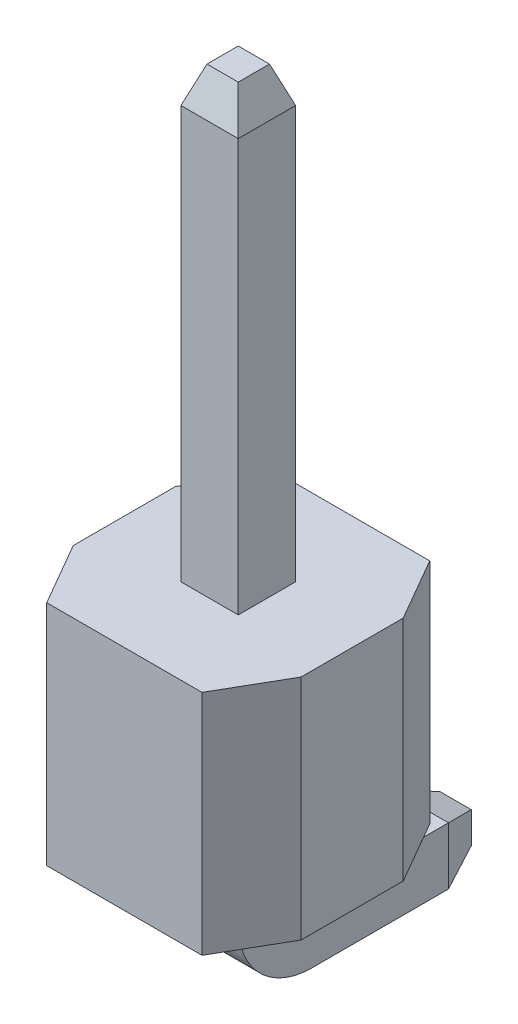
ISO-10303-21;
HEADER;
FILE_DESCRIPTION(('STEP AP214'),'2;1');
FILE_NAME('part.step','',(''),(''),'','','');
FILE_SCHEMA(('AUTOMOTIVE_DESIGN { 1 0 10303 214 1 1 1 1 }'));
ENDSEC;
DATA;
#1=APPLICATION_CONTEXT('core data for automotive mechanical design processes');
#2=APPLICATION_PROTOCOL_DEFINITION('international standard','automotive_design',2000,#1);
#3=PRODUCT_CONTEXT('',#1,'mechanical');
#4=PRODUCT('Part','Part','',(#3));
#5=PRODUCT_RELATED_PRODUCT_CATEGORY('part','',(#4));
#6=PRODUCT_DEFINITION_FORMATION('','',#4);
#7=PRODUCT_DEFINITION_CONTEXT('part definition',#1,'design');
#8=PRODUCT_DEFINITION('design','',#6,#7);
#9=PRODUCT_DEFINITION_SHAPE('','',#8);
#10=(LENGTH_UNIT() NAMED_UNIT(*) SI_UNIT(.MILLI.,.METRE.));
#11=(NAMED_UNIT(*) PLANE_ANGLE_UNIT() SI_UNIT($,.RADIAN.));
#12=(NAMED_UNIT(*) SI_UNIT($,.STERADIAN.) SOLID_ANGLE_UNIT());
#13=UNCERTAINTY_MEASURE_WITH_UNIT(LENGTH_MEASURE(1.E-05),#10,'distance_accuracy_value','');
#14=(GEOMETRIC_REPRESENTATION_CONTEXT(3) GLOBAL_UNCERTAINTY_ASSIGNED_CONTEXT((#13)) GLOBAL_UNIT_ASSIGNED_CONTEXT((#10,
#11,#12)) REPRESENTATION_CONTEXT('',''));
#15=CARTESIAN_POINT('',(0.,0.,0.));
#16=DIRECTION('',(0.,0.,1.));
#17=DIRECTION('',(1.,0.,0.));
#18=AXIS2_PLACEMENT_3D('',#15,#16,#17);
#19=CARTESIAN_POINT('',(-1.27,-1.85951577387363,1.15426019491226));
#20=DIRECTION('',(1.,0.,0.));
#21=DIRECTION('',(0.,0.,-1.));
#22=AXIS2_PLACEMENT_3D('',#19,#20,#21);
#23=PLANE('',#22);
#24=DIRECTION('',(0.,0.,1.));
#25=VECTOR('',#24,1.);
#26=CARTESIAN_POINT('',(-1.27,-4.39951577387363,1.15426019491226));
#27=LINE('',#26,#25);
#28=CARTESIAN_POINT('',(-1.27,-4.39951577387363,1.85426019491226));
#29=VERTEX_POINT('',#28);
#30=CARTESIAN_POINT('',(-1.27,-4.39951577387363,2.99426019491226));
#31=VERTEX_POINT('',#30);
#32=EDGE_CURVE('E139',#29,#31,#27,.T.);
#33=ORIENTED_EDGE('',*,*,#32,.T.);
#34=DIRECTION('',(0.,1.,0.));
#35=VECTOR('',#34,1.);
#36=CARTESIAN_POINT('',(-1.27,-1.85951577387363,2.99426019491226));
#37=LINE('',#36,#35);
#38=CARTESIAN_POINT('',(-1.27,-1.85951577387363,2.99426019491226));
#39=VERTEX_POINT('',#38);
#40=EDGE_CURVE('E116',#31,#39,#37,.T.);
#41=ORIENTED_EDGE('',*,*,#40,.T.);
#42=DIRECTION('',(0.,0.,1.));
#43=VECTOR('',#42,1.);
#44=CARTESIAN_POINT('',(-1.27,-1.85951577387363,1.15426019491226));
#45=LINE('',#44,#43);
#46=CARTESIAN_POINT('',(-1.27,-1.85951577387363,1.85426019491226));
#47=VERTEX_POINT('',#46);
#48=EDGE_CURVE('E148',#47,#39,#45,.T.);
#49=ORIENTED_EDGE('',*,*,#48,.F.);
#50=DIRECTION('',(0.,-1.,0.));
#51=VECTOR('',#50,1.);
#52=CARTESIAN_POINT('',(-1.27,-1.85951577387363,1.85426019491227));
#53=LINE('',#52,#51);
#54=EDGE_CURVE('E121',#47,#29,#53,.T.);
#55=ORIENTED_EDGE('',*,*,#54,.T.);
#56=EDGE_LOOP('',(#33,#41,#49,#55));
#57=FACE_BOUND('',#56,.T.);
#58=ADVANCED_FACE('F44',(#57),#23,.F.);
#59=CARTESIAN_POINT('',(1.27,-1.85951577387363,3.69426019491226));
#60=DIRECTION('',(0.,0.,-1.));
#61=DIRECTION('',(-1.,0.,0.));
#62=AXIS2_PLACEMENT_3D('',#59,#60,#61);
#63=PLANE('',#62);
#64=DIRECTION('',(1.,0.,0.));
#65=VECTOR('',#64,1.);
#66=CARTESIAN_POINT('',(1.27,-1.85951577387363,3.69426019491226));
#67=LINE('',#66,#65);
#68=CARTESIAN_POINT('',(-0.865854811567262,-1.85951577387363,3.69426019491226));
#69=VERTEX_POINT('',#68);
#70=CARTESIAN_POINT('',(0.865854811567261,-1.85951577387363,3.69426019491226));
#71=VERTEX_POINT('',#70);
#72=EDGE_CURVE('E131',#69,#71,#67,.T.);
#73=ORIENTED_EDGE('',*,*,#72,.F.);
#74=DIRECTION('',(0.,-1.,0.));
#75=VECTOR('',#74,1.);
#76=CARTESIAN_POINT('',(-0.865854811567262,-1.85951577387363,3.69426019491226));
#77=LINE('',#76,#75);
#78=CARTESIAN_POINT('',(-0.865854811567262,-4.39951577387363,3.69426019491226));
#79=VERTEX_POINT('',#78);
#80=EDGE_CURVE('E115',#69,#79,#77,.T.);
#81=ORIENTED_EDGE('',*,*,#80,.T.);
#82=DIRECTION('',(1.,0.,0.));
#83=VECTOR('',#82,1.);
#84=CARTESIAN_POINT('',(1.27,-4.39951577387363,3.69426019491226));
#85=LINE('',#84,#83);
#86=CARTESIAN_POINT('',(0.865854811567261,-4.39951577387363,3.69426019491226));
#87=VERTEX_POINT('',#86);
#88=EDGE_CURVE('E128',#79,#87,#85,.T.);
#89=ORIENTED_EDGE('',*,*,#88,.T.);
#90=DIRECTION('',(0.,1.,0.));
#91=VECTOR('',#90,1.);
#92=CARTESIAN_POINT('',(0.865854811567261,-1.85951577387363,3.69426019491226));
#93=LINE('',#92,#91);
#94=EDGE_CURVE('E133',#87,#71,#93,.T.);
#95=ORIENTED_EDGE('',*,*,#94,.T.);
#96=EDGE_LOOP('',(#73,#81,#89,#95));
#97=FACE_BOUND('',#96,.T.);
#98=ADVANCED_FACE('F127',(#97),#63,.F.);
#99=CARTESIAN_POINT('',(1.27,-1.85951577387363,1.15426019491226));
#100=DIRECTION('',(-1.,0.,0.));
#101=DIRECTION('',(0.,0.,1.));
#102=AXIS2_PLACEMENT_3D('',#99,#100,#101);
#103=PLANE('',#102);
#104=DIRECTION('',(0.,0.,-1.));
#105=VECTOR('',#104,1.);
#106=CARTESIAN_POINT('',(1.27,-1.85951577387363,1.15426019491226));
#107=LINE('',#106,#105);
#108=CARTESIAN_POINT('',(1.27,-1.85951577387363,2.99426019491226));
#109=VERTEX_POINT('',#108);
#110=CARTESIAN_POINT('',(1.27,-1.85951577387363,1.85426019491227));
#111=VERTEX_POINT('',#110);
#112=EDGE_CURVE('E171',#109,#111,#107,.T.);
#113=ORIENTED_EDGE('',*,*,#112,.F.);
#114=DIRECTION('',(0.,-1.,0.));
#115=VECTOR('',#114,1.);
#116=CARTESIAN_POINT('',(1.27,-1.85951577387363,2.99426019491226));
#117=LINE('',#116,#115);
#118=CARTESIAN_POINT('',(1.27,-4.39951577387363,2.99426019491226));
#119=VERTEX_POINT('',#118);
#120=EDGE_CURVE('E12',#109,#119,#117,.T.);
#121=ORIENTED_EDGE('',*,*,#120,.T.);
#122=DIRECTION('',(0.,0.,-1.));
#123=VECTOR('',#122,1.);
#124=CARTESIAN_POINT('',(1.27,-4.39951577387363,1.15426019491226));
#125=LINE('',#124,#123);
#126=CARTESIAN_POINT('',(1.27,-4.39951577387363,1.85426019491227));
#127=VERTEX_POINT('',#126);
#128=EDGE_CURVE('E138',#119,#127,#125,.T.);
#129=ORIENTED_EDGE('',*,*,#128,.T.);
#130=DIRECTION('',(0.,1.,0.));
#131=VECTOR('',#130,1.);
#132=CARTESIAN_POINT('',(1.27,-1.85951577387363,1.85426019491227));
#133=LINE('',#132,#131);
#134=EDGE_CURVE('E52',#127,#111,#133,.T.);
#135=ORIENTED_EDGE('',*,*,#134,.T.);
#136=EDGE_LOOP('',(#113,#121,#129,#135));
#137=FACE_BOUND('',#136,.T.);
#138=ADVANCED_FACE('F170',(#137),#103,.F.);
#139=CARTESIAN_POINT('',(1.27,-1.85951577387363,1.15426019491226));
#140=DIRECTION('',(0.,0.,1.));
#141=DIRECTION('',(1.,0.,0.));
#142=AXIS2_PLACEMENT_3D('',#139,#140,#141);
#143=PLANE('',#142);
#144=DIRECTION('',(-1.,0.,0.));
#145=VECTOR('',#144,1.);
#146=CARTESIAN_POINT('',(1.27,-4.39951577387363,1.15426019491226));
#147=LINE('',#146,#145);
#148=CARTESIAN_POINT('',(0.865854811567261,-4.39951577387363,1.15426019491226));
#149=VERTEX_POINT('',#148);
#150=CARTESIAN_POINT('',(-0.865854811567262,-4.39951577387363,1.15426019491226));
#151=VERTEX_POINT('',#150);
#152=EDGE_CURVE('E142',#149,#151,#147,.T.);
#153=ORIENTED_EDGE('',*,*,#152,.T.);
#154=DIRECTION('',(0.,1.,0.));
#155=VECTOR('',#154,1.);
#156=CARTESIAN_POINT('',(-0.865854811567262,-1.85951577387363,1.15426019491226));
#157=LINE('',#156,#155);
#158=CARTESIAN_POINT('',(-0.865854811567262,-1.85951577387363,1.15426019491226));
#159=VERTEX_POINT('',#158);
#160=EDGE_CURVE('E59',#151,#159,#157,.T.);
#161=ORIENTED_EDGE('',*,*,#160,.T.);
#162=DIRECTION('',(-1.,0.,0.));
#163=VECTOR('',#162,1.);
#164=CARTESIAN_POINT('',(1.27,-1.85951577387363,1.15426019491226));
#165=LINE('',#164,#163);
#166=CARTESIAN_POINT('',(0.865854811567261,-1.85951577387363,1.15426019491226));
#167=VERTEX_POINT('',#166);
#168=EDGE_CURVE('E149',#167,#159,#165,.T.);
#169=ORIENTED_EDGE('',*,*,#168,.F.);
#170=DIRECTION('',(0.,-1.,0.));
#171=VECTOR('',#170,1.);
#172=CARTESIAN_POINT('',(0.865854811567261,-1.85951577387363,1.15426019491226));
#173=LINE('',#172,#171);
#174=EDGE_CURVE('E164',#167,#149,#173,.T.);
#175=ORIENTED_EDGE('',*,*,#174,.T.);
#176=EDGE_LOOP('',(#153,#161,#169,#175));
#177=FACE_BOUND('',#176,.T.);
#178=ADVANCED_FACE('F180',(#177),#143,.F.);
#179=CARTESIAN_POINT('',(-1.27,-1.85951577387363,3.69426019491226));
#180=DIRECTION('',(0.,-1.,0.));
#181=DIRECTION('',(0.,0.,-1.));
#182=AXIS2_PLACEMENT_3D('',#179,#180,#181);
#183=PLANE('',#182);
#184=ORIENTED_EDGE('',*,*,#48,.T.);
#185=DIRECTION('',(-0.499999999999998,0.,-0.86602540378444));
#186=VECTOR('',#185,1.);
#187=CARTESIAN_POINT('',(-0.865854811567262,-1.85951577387363,3.69426019491226));
#188=LINE('',#187,#186);
#189=EDGE_CURVE('E162',#39,#69,#188,.F.);
#190=ORIENTED_EDGE('',*,*,#189,.T.);
#191=ORIENTED_EDGE('',*,*,#72,.T.);
#192=DIRECTION('',(-0.499999999999998,0.,0.86602540378444));
#193=VECTOR('',#192,1.);
#194=CARTESIAN_POINT('',(1.27,-1.85951577387363,2.99426019491226));
#195=LINE('',#194,#193);
#196=EDGE_CURVE('E158',#71,#109,#195,.F.);
#197=ORIENTED_EDGE('',*,*,#196,.T.);
#198=ORIENTED_EDGE('',*,*,#112,.T.);
#199=DIRECTION('',(0.499999999999998,0.,0.86602540378444));
#200=VECTOR('',#199,1.);
#201=CARTESIAN_POINT('',(0.865854811567261,-1.85951577387363,1.15426019491226));
#202=LINE('',#201,#200);
#203=EDGE_CURVE('E66',#111,#167,#202,.F.);
#204=ORIENTED_EDGE('',*,*,#203,.T.);
#205=ORIENTED_EDGE('',*,*,#168,.T.);
#206=DIRECTION('',(0.499999999999998,0.,-0.86602540378444));
#207=VECTOR('',#206,1.);
#208=CARTESIAN_POINT('',(-1.27,-1.85951577387363,1.85426019491227));
#209=LINE('',#208,#207);
#210=EDGE_CURVE('E160',#159,#47,#209,.F.);
#211=ORIENTED_EDGE('',*,*,#210,.T.);
#212=EDGE_LOOP('',(#184,#190,#191,#197,#198,#204,#205,#211));
#213=FACE_BOUND('',#212,.T.);
#214=ADVANCED_FACE('F175',(#213),#183,.F.);
#215=CARTESIAN_POINT('',(-1.27,-4.39951577387363,3.69426019491226));
#216=DIRECTION('',(0.,-1.,0.));
#217=DIRECTION('',(0.,0.,-1.));
#218=AXIS2_PLACEMENT_3D('',#215,#216,#217);
#219=PLANE('',#218);
#220=ORIENTED_EDGE('',*,*,#88,.F.);
#221=DIRECTION('',(0.499999999999998,0.,0.86602540378444));
#222=VECTOR('',#221,1.);
#223=CARTESIAN_POINT('',(-0.966891108675446,-4.39951577387363,3.51926019491226));
#224=LINE('',#223,#222);
#225=EDGE_CURVE('E111',#79,#31,#224,.F.);
#226=ORIENTED_EDGE('',*,*,#225,.T.);
#227=ORIENTED_EDGE('',*,*,#32,.F.);
#228=DIRECTION('',(-0.499999999999998,0.,0.86602540378444));
#229=VECTOR('',#228,1.);
#230=CARTESIAN_POINT('',(-2.06674337148168,-4.39951577387363,3.23426019491227));
#231=LINE('',#230,#229);
#232=EDGE_CURVE('E122',#29,#151,#231,.F.);
#233=ORIENTED_EDGE('',*,*,#232,.T.);
#234=ORIENTED_EDGE('',*,*,#152,.F.);
#235=DIRECTION('',(-0.499999999999998,0.,-0.86602540378444));
#236=VECTOR('',#235,1.);
#237=CARTESIAN_POINT('',(1.43174337148168,-4.39951577387363,2.13440793210603));
#238=LINE('',#237,#236);
#239=EDGE_CURVE('E132',#149,#127,#238,.F.);
#240=ORIENTED_EDGE('',*,*,#239,.T.);
#241=ORIENTED_EDGE('',*,*,#128,.F.);
#242=DIRECTION('',(0.499999999999998,0.,-0.86602540378444));
#243=VECTOR('',#242,1.);
#244=CARTESIAN_POINT('',(0.33189110867545,-4.39951577387363,4.6191124577185));
#245=LINE('',#244,#243);
#246=EDGE_CURVE('E137',#119,#87,#245,.F.);
#247=ORIENTED_EDGE('',*,*,#246,.T.);
#248=EDGE_LOOP('',(#220,#226,#227,#233,#234,#240,#241,#247));
#249=FACE_BOUND('',#248,.T.);
#250=ADVANCED_FACE('F135',(#249),#219,.T.);
#251=CARTESIAN_POINT('',(-0.865854811567262,-1.85951577387363,3.69426019491226));
#252=DIRECTION('',(0.86602540378444,0.,-0.499999999999998));
#253=DIRECTION('',(-0.499999999999998,0.,-0.86602540378444));
#254=AXIS2_PLACEMENT_3D('',#251,#252,#253);
#255=PLANE('',#254);
#256=ORIENTED_EDGE('',*,*,#189,.F.);
#257=ORIENTED_EDGE('',*,*,#40,.F.);
#258=ORIENTED_EDGE('',*,*,#225,.F.);
#259=ORIENTED_EDGE('',*,*,#80,.F.);
#260=EDGE_LOOP('',(#256,#257,#258,#259));
#261=FACE_BOUND('',#260,.T.);
#262=ADVANCED_FACE('F114',(#261),#255,.F.);
#263=CARTESIAN_POINT('',(-1.27,-1.85951577387363,1.85426019491227));
#264=DIRECTION('',(0.86602540378444,0.,0.499999999999998));
#265=DIRECTION('',(0.499999999999998,0.,-0.86602540378444));
#266=AXIS2_PLACEMENT_3D('',#263,#264,#265);
#267=PLANE('',#266);
#268=ORIENTED_EDGE('',*,*,#210,.F.);
#269=ORIENTED_EDGE('',*,*,#160,.F.);
#270=ORIENTED_EDGE('',*,*,#232,.F.);
#271=ORIENTED_EDGE('',*,*,#54,.F.);
#272=EDGE_LOOP('',(#268,#269,#270,#271));
#273=FACE_BOUND('',#272,.T.);
#274=ADVANCED_FACE('F184',(#273),#267,.F.);
#275=CARTESIAN_POINT('',(1.27,-1.85951577387363,2.99426019491226));
#276=DIRECTION('',(-0.86602540378444,0.,-0.499999999999998));
#277=DIRECTION('',(-0.499999999999998,0.,0.86602540378444));
#278=AXIS2_PLACEMENT_3D('',#275,#276,#277);
#279=PLANE('',#278);
#280=ORIENTED_EDGE('',*,*,#196,.F.);
#281=ORIENTED_EDGE('',*,*,#94,.F.);
#282=ORIENTED_EDGE('',*,*,#246,.F.);
#283=ORIENTED_EDGE('',*,*,#120,.F.);
#284=EDGE_LOOP('',(#280,#281,#282,#283));
#285=FACE_BOUND('',#284,.T.);
#286=ADVANCED_FACE('F190',(#285),#279,.F.);
#287=CARTESIAN_POINT('',(0.865854811567261,-1.85951577387363,1.15426019491226));
#288=DIRECTION('',(-0.86602540378444,0.,0.499999999999998));
#289=DIRECTION('',(0.499999999999998,0.,0.86602540378444));
#290=AXIS2_PLACEMENT_3D('',#287,#288,#289);
#291=PLANE('',#290);
#292=ORIENTED_EDGE('',*,*,#203,.F.);
#293=ORIENTED_EDGE('',*,*,#134,.F.);
#294=ORIENTED_EDGE('',*,*,#239,.F.);
#295=ORIENTED_EDGE('',*,*,#174,.F.);
#296=EDGE_LOOP('',(#292,#293,#294,#295));
#297=FACE_BOUND('',#296,.T.);
#298=ADVANCED_FACE('F46',(#297),#291,.F.);
#299=CLOSED_SHELL('',(#58,#98,#138,#178,#214,#250,#262,#274,#286,#298));
#300=MANIFOLD_SOLID_BREP('B2',#299);
#301=CARTESIAN_POINT('',(0.32,-4.85951577387363,2.74426019491226));
#302=DIRECTION('',(0.,0.,1.));
#303=DIRECTION('',(1.,0.,0.));
#304=AXIS2_PLACEMENT_3D('',#301,#302,#303);
#305=PLANE('',#304);
#306=DIRECTION('',(0.,1.,0.));
#307=VECTOR('',#306,1.);
#308=CARTESIAN_POINT('',(0.32,-4.85951577387363,2.74426019491226));
#309=LINE('',#308,#307);
#310=CARTESIAN_POINT('',(0.32,-4.85951577387363,2.74426019491226));
#311=VERTEX_POINT('',#310);
#312=CARTESIAN_POINT('',(0.32,2.74048422612637,2.74426019491226));
#313=VERTEX_POINT('',#312);
#314=EDGE_CURVE('E412',#311,#313,#309,.T.);
#315=ORIENTED_EDGE('',*,*,#314,.T.);
#316=DIRECTION('',(-1.,0.,0.));
#317=VECTOR('',#316,1.);
#318=CARTESIAN_POINT('',(-0.32,2.74048422612637,2.74426019491226));
#319=LINE('',#318,#317);
#320=CARTESIAN_POINT('',(-0.32,2.74048422612637,2.74426019491226));
#321=VERTEX_POINT('',#320);
#322=EDGE_CURVE('E42',#313,#321,#319,.T.);
#323=ORIENTED_EDGE('',*,*,#322,.T.);
#324=DIRECTION('',(0.,1.,0.));
#325=VECTOR('',#324,1.);
#326=CARTESIAN_POINT('',(-0.32,-4.85951577387363,2.74426019491226));
#327=LINE('',#326,#325);
#328=CARTESIAN_POINT('',(-0.32,-4.85951577387363,2.74426019491226));
#329=VERTEX_POINT('',#328);
#330=EDGE_CURVE('E415',#329,#321,#327,.T.);
#331=ORIENTED_EDGE('',*,*,#330,.F.);
#332=DIRECTION('',(1.,0.,0.));
#333=VECTOR('',#332,1.);
#334=CARTESIAN_POINT('',(0.32,-4.85951577387363,2.74426019491226));
#335=LINE('',#334,#333);
#336=EDGE_CURVE('E369',#329,#311,#335,.T.);
#337=ORIENTED_EDGE('',*,*,#336,.T.);
#338=EDGE_LOOP('',(#315,#323,#331,#337));
#339=FACE_BOUND('',#338,.T.);
#340=ADVANCED_FACE('F271',(#339),#305,.T.);
#341=CARTESIAN_POINT('',(0.32,-4.85951577387363,2.10426019491226));
#342=DIRECTION('',(0.,0.,-1.));
#343=DIRECTION('',(-1.,0.,0.));
#344=AXIS2_PLACEMENT_3D('',#341,#342,#343);
#345=PLANE('',#344);
#346=DIRECTION('',(0.,1.,0.));
#347=VECTOR('',#346,1.);
#348=CARTESIAN_POINT('',(-0.32,-4.85951577387363,2.10426019491226));
#349=LINE('',#348,#347);
#350=CARTESIAN_POINT('',(-0.32,-4.85951577387363,2.10426019491226));
#351=VERTEX_POINT('',#350);
#352=CARTESIAN_POINT('',(-0.32,2.74048422612637,2.10426019491226));
#353=VERTEX_POINT('',#352);
#354=EDGE_CURVE('E373',#351,#353,#349,.T.);
#355=ORIENTED_EDGE('',*,*,#354,.T.);
#356=DIRECTION('',(1.,0.,0.));
#357=VECTOR('',#356,1.);
#358=CARTESIAN_POINT('',(0.32,2.74048422612637,2.10426019491226));
#359=LINE('',#358,#357);
#360=CARTESIAN_POINT('',(0.32,2.74048422612637,2.10426019491226));
#361=VERTEX_POINT('',#360);
#362=EDGE_CURVE('E280',#353,#361,#359,.T.);
#363=ORIENTED_EDGE('',*,*,#362,.T.);
#364=DIRECTION('',(0.,1.,0.));
#365=VECTOR('',#364,1.);
#366=CARTESIAN_POINT('',(0.32,-4.85951577387363,2.10426019491226));
#367=LINE('',#366,#365);
#368=CARTESIAN_POINT('',(0.32,-4.85951577387363,2.10426019491226));
#369=VERTEX_POINT('',#368);
#370=EDGE_CURVE('E409',#369,#361,#367,.T.);
#371=ORIENTED_EDGE('',*,*,#370,.F.);
#372=DIRECTION('',(-1.,0.,0.));
#373=VECTOR('',#372,1.);
#374=CARTESIAN_POINT('',(0.32,-4.85951577387363,2.10426019491226));
#375=LINE('',#374,#373);
#376=EDGE_CURVE('E391',#369,#351,#375,.T.);
#377=ORIENTED_EDGE('',*,*,#376,.T.);
#378=EDGE_LOOP('',(#355,#363,#371,#377));
#379=FACE_BOUND('',#378,.T.);
#380=ADVANCED_FACE('F473',(#379),#345,.T.);
#381=CARTESIAN_POINT('',(0.,-4.85951577387363,1.92426019491226));
#382=DIRECTION('',(-1.,0.,0.));
#383=DIRECTION('',(0.,0.,1.));
#384=AXIS2_PLACEMENT_3D('',#381,#382,#383);
#385=CYLINDRICAL_SURFACE('',#384,0.82);
#386=DIRECTION('',(1.,0.,0.));
#387=VECTOR('',#386,1.);
#388=CARTESIAN_POINT('',(0.32,-5.67951577387363,1.92426019491226));
#389=LINE('',#388,#387);
#390=CARTESIAN_POINT('',(-0.32,-5.67951577387363,1.92426019491226));
#391=VERTEX_POINT('',#390);
#392=CARTESIAN_POINT('',(0.32,-5.67951577387363,1.92426019491226));
#393=VERTEX_POINT('',#392);
#394=EDGE_CURVE('E366',#391,#393,#389,.T.);
#395=ORIENTED_EDGE('',*,*,#394,.T.);
#396=CARTESIAN_POINT('',(0.32,-4.85951577387363,1.92426019491226));
#397=DIRECTION('',(-1.,0.,0.));
#398=DIRECTION('',(0.,0.,1.));
#399=AXIS2_PLACEMENT_3D('',#396,#397,#398);
#400=CIRCLE('',#399,0.82);
#401=EDGE_CURVE('E374',#393,#311,#400,.T.);
#402=ORIENTED_EDGE('',*,*,#401,.T.);
#403=ORIENTED_EDGE('',*,*,#336,.F.);
#404=CARTESIAN_POINT('',(-0.32,-4.85951577387363,1.92426019491226));
#405=DIRECTION('',(-1.,0.,0.));
#406=DIRECTION('',(0.,0.,1.));
#407=AXIS2_PLACEMENT_3D('',#404,#405,#406);
#408=CIRCLE('',#407,0.82);
#409=EDGE_CURVE('E362',#391,#329,#408,.T.);
#410=ORIENTED_EDGE('',*,*,#409,.F.);
#411=EDGE_LOOP('',(#395,#402,#403,#410));
#412=FACE_BOUND('',#411,.T.);
#413=ADVANCED_FACE('F364',(#412),#385,.T.);
#414=CARTESIAN_POINT('',(0.,-4.85951577387363,1.92426019491226));
#415=DIRECTION('',(-1.,0.,0.));
#416=DIRECTION('',(0.,0.,1.));
#417=AXIS2_PLACEMENT_3D('',#414,#415,#416);
#418=CYLINDRICAL_SURFACE('',#417,0.18);
#419=DIRECTION('',(-1.,0.,0.));
#420=VECTOR('',#419,1.);
#421=CARTESIAN_POINT('',(0.32,-5.03951577387363,1.92426019491226));
#422=LINE('',#421,#420);
#423=CARTESIAN_POINT('',(0.32,-5.03951577387363,1.92426019491226));
#424=VERTEX_POINT('',#423);
#425=CARTESIAN_POINT('',(-0.32,-5.03951577387363,1.92426019491226));
#426=VERTEX_POINT('',#425);
#427=EDGE_CURVE('E384',#424,#426,#422,.T.);
#428=ORIENTED_EDGE('',*,*,#427,.T.);
#429=CARTESIAN_POINT('',(-0.32,-4.85951577387363,1.92426019491226));
#430=DIRECTION('',(-1.,0.,0.));
#431=DIRECTION('',(0.,0.,1.));
#432=AXIS2_PLACEMENT_3D('',#429,#430,#431);
#433=CIRCLE('',#432,0.18);
#434=EDGE_CURVE('E400',#426,#351,#433,.T.);
#435=ORIENTED_EDGE('',*,*,#434,.T.);
#436=ORIENTED_EDGE('',*,*,#376,.F.);
#437=CARTESIAN_POINT('',(0.32,-4.85951577387363,1.92426019491226));
#438=DIRECTION('',(-1.,0.,0.));
#439=DIRECTION('',(0.,0.,1.));
#440=AXIS2_PLACEMENT_3D('',#437,#438,#439);
#441=CIRCLE('',#440,0.18);
#442=EDGE_CURVE('E403',#424,#369,#441,.T.);
#443=ORIENTED_EDGE('',*,*,#442,.F.);
#444=EDGE_LOOP('',(#428,#435,#436,#443));
#445=FACE_BOUND('',#444,.T.);
#446=ADVANCED_FACE('F584',(#445),#418,.F.);
#447=CARTESIAN_POINT('',(-0.32,-5.03951577387363,1.92426019491226));
#448=DIRECTION('',(1.,0.,0.));
#449=DIRECTION('',(0.,1.,0.));
#450=AXIS2_PLACEMENT_3D('',#447,#448,#449);
#451=PLANE('',#450);
#452=DIRECTION('',(0.,0.,-1.));
#453=VECTOR('',#452,1.);
#454=CARTESIAN_POINT('',(-0.32,-5.03951577387363,1.92426019491226));
#455=LINE('',#454,#453);
#456=CARTESIAN_POINT('',(-0.32,-5.03951577387363,0.400000000000003));
#457=VERTEX_POINT('',#456);
#458=EDGE_CURVE('E625',#426,#457,#455,.T.);
#459=ORIENTED_EDGE('',*,*,#458,.T.);
#460=DIRECTION('',(0.,-1.,0.));
#461=VECTOR('',#460,1.);
#462=CARTESIAN_POINT('',(-0.32,-5.67951577387363,0.400000000000003));
#463=LINE('',#462,#461);
#464=CARTESIAN_POINT('',(-0.32,-5.67951577387363,0.400000000000003));
#465=VERTEX_POINT('',#464);
#466=EDGE_CURVE('E390',#457,#465,#463,.T.);
#467=ORIENTED_EDGE('',*,*,#466,.T.);
#468=DIRECTION('',(0.,0.,-1.));
#469=VECTOR('',#468,1.);
#470=CARTESIAN_POINT('',(-0.32,-5.67951577387363,1.92426019491226));
#471=LINE('',#470,#469);
#472=EDGE_CURVE('E380',#391,#465,#471,.T.);
#473=ORIENTED_EDGE('',*,*,#472,.F.);
#474=ORIENTED_EDGE('',*,*,#409,.T.);
#475=ORIENTED_EDGE('',*,*,#330,.T.);
#476=DIRECTION('',(0.,0.,-1.));
#477=VECTOR('',#476,1.);
#478=CARTESIAN_POINT('',(-0.32,2.74048422612637,1.92426019491226));
#479=LINE('',#478,#477);
#480=EDGE_CURVE('E434',#321,#353,#479,.T.);
#481=ORIENTED_EDGE('',*,*,#480,.T.);
#482=ORIENTED_EDGE('',*,*,#354,.F.);
#483=ORIENTED_EDGE('',*,*,#434,.F.);
#484=EDGE_LOOP('',(#459,#467,#473,#474,#475,#481,#482,#483));
#485=FACE_BOUND('',#484,.T.);
#486=ADVANCED_FACE('F388',(#485),#451,.F.);
#487=CARTESIAN_POINT('',(0.32,-5.67951577387363,1.92426019491226));
#488=DIRECTION('',(0.,1.,0.));
#489=DIRECTION('',(0.,0.,1.));
#490=AXIS2_PLACEMENT_3D('',#487,#488,#489);
#491=PLANE('',#490);
#492=ORIENTED_EDGE('',*,*,#472,.T.);
#493=DIRECTION('',(1.,0.,0.));
#494=VECTOR('',#493,1.);
#495=CARTESIAN_POINT('',(0.32,-5.67951577387363,0.400000000000003));
#496=LINE('',#495,#494);
#497=CARTESIAN_POINT('',(0.32,-5.67951577387363,0.400000000000003));
#498=VERTEX_POINT('',#497);
#499=EDGE_CURVE('E417',#465,#498,#496,.T.);
#500=ORIENTED_EDGE('',*,*,#499,.T.);
#501=DIRECTION('',(0.,0.,-1.));
#502=VECTOR('',#501,1.);
#503=CARTESIAN_POINT('',(0.32,-5.67951577387363,1.92426019491226));
#504=LINE('',#503,#502);
#505=EDGE_CURVE('E383',#393,#498,#504,.T.);
#506=ORIENTED_EDGE('',*,*,#505,.F.);
#507=ORIENTED_EDGE('',*,*,#394,.F.);
#508=EDGE_LOOP('',(#492,#500,#506,#507));
#509=FACE_BOUND('',#508,.T.);
#510=ADVANCED_FACE('F378',(#509),#491,.F.);
#511=CARTESIAN_POINT('',(0.32,-5.03951577387363,1.92426019491226));
#512=DIRECTION('',(-1.,0.,0.));
#513=DIRECTION('',(0.,-1.,0.));
#514=AXIS2_PLACEMENT_3D('',#511,#512,#513);
#515=PLANE('',#514);
#516=ORIENTED_EDGE('',*,*,#505,.T.);
#517=DIRECTION('',(0.,1.,0.));
#518=VECTOR('',#517,1.);
#519=CARTESIAN_POINT('',(0.32,-5.03951577387363,0.400000000000003));
#520=LINE('',#519,#518);
#521=CARTESIAN_POINT('',(0.32,-5.03951577387363,0.400000000000003));
#522=VERTEX_POINT('',#521);
#523=EDGE_CURVE('E430',#498,#522,#520,.T.);
#524=ORIENTED_EDGE('',*,*,#523,.T.);
#525=DIRECTION('',(0.,0.,-1.));
#526=VECTOR('',#525,1.);
#527=CARTESIAN_POINT('',(0.32,-5.03951577387363,1.92426019491226));
#528=LINE('',#527,#526);
#529=EDGE_CURVE('E395',#424,#522,#528,.T.);
#530=ORIENTED_EDGE('',*,*,#529,.F.);
#531=ORIENTED_EDGE('',*,*,#442,.T.);
#532=ORIENTED_EDGE('',*,*,#370,.T.);
#533=DIRECTION('',(0.,0.,1.));
#534=VECTOR('',#533,1.);
#535=CARTESIAN_POINT('',(0.32,2.74048422612637,1.92426019491226));
#536=LINE('',#535,#534);
#537=EDGE_CURVE('E428',#361,#313,#536,.T.);
#538=ORIENTED_EDGE('',*,*,#537,.T.);
#539=ORIENTED_EDGE('',*,*,#314,.F.);
#540=ORIENTED_EDGE('',*,*,#401,.F.);
#541=EDGE_LOOP('',(#516,#524,#530,#531,#532,#538,#539,#540));
#542=FACE_BOUND('',#541,.T.);
#543=ADVANCED_FACE('F491',(#542),#515,.F.);
#544=CARTESIAN_POINT('',(0.32,-5.03951577387363,1.92426019491226));
#545=DIRECTION('',(0.,-1.,0.));
#546=DIRECTION('',(0.,0.,-1.));
#547=AXIS2_PLACEMENT_3D('',#544,#545,#546);
#548=PLANE('',#547);
#549=ORIENTED_EDGE('',*,*,#529,.T.);
#550=DIRECTION('',(-1.,0.,0.));
#551=VECTOR('',#550,1.);
#552=CARTESIAN_POINT('',(-0.32,-5.03951577387363,0.400000000000003));
#553=LINE('',#552,#551);
#554=EDGE_CURVE('E432',#522,#457,#553,.T.);
#555=ORIENTED_EDGE('',*,*,#554,.T.);
#556=ORIENTED_EDGE('',*,*,#458,.F.);
#557=ORIENTED_EDGE('',*,*,#427,.F.);
#558=EDGE_LOOP('',(#549,#555,#556,#557));
#559=FACE_BOUND('',#558,.T.);
#560=ADVANCED_FACE('F482',(#559),#548,.F.);
#561=CARTESIAN_POINT('',(-0.32,3.14048422612637,2.74426019491226));
#562=DIRECTION('',(0.,-1.,0.));
#563=DIRECTION('',(-1.,0.,0.));
#564=AXIS2_PLACEMENT_3D('',#561,#562,#563);
#565=PLANE('',#564);
#566=DIRECTION('',(0.,0.,-1.));
#567=VECTOR('',#566,1.);
#568=CARTESIAN_POINT('',(0.174411906293519,3.14048422612637,2.74426019491226));
#569=LINE('',#568,#567);
#570=CARTESIAN_POINT('',(0.174411906293519,3.14048422612637,2.59867210120578));
#571=VERTEX_POINT('',#570);
#572=CARTESIAN_POINT('',(0.174411906293519,3.14048422612637,2.24984828861874));
#573=VERTEX_POINT('',#572);
#574=EDGE_CURVE('E288',#571,#573,#569,.T.);
#575=ORIENTED_EDGE('',*,*,#574,.T.);
#576=DIRECTION('',(-1.,0.,0.));
#577=VECTOR('',#576,1.);
#578=CARTESIAN_POINT('',(-0.32,3.14048422612637,2.24984828861874));
#579=LINE('',#578,#577);
#580=CARTESIAN_POINT('',(-0.17441190629352,3.14048422612637,2.24984828861874));
#581=VERTEX_POINT('',#580);
#582=EDGE_CURVE('E441',#573,#581,#579,.T.);
#583=ORIENTED_EDGE('',*,*,#582,.T.);
#584=DIRECTION('',(0.,0.,1.));
#585=VECTOR('',#584,1.);
#586=CARTESIAN_POINT('',(-0.17441190629352,3.14048422612637,2.74426019491226));
#587=LINE('',#586,#585);
#588=CARTESIAN_POINT('',(-0.17441190629352,3.14048422612637,2.59867210120578));
#589=VERTEX_POINT('',#588);
#590=EDGE_CURVE('E437',#581,#589,#587,.T.);
#591=ORIENTED_EDGE('',*,*,#590,.T.);
#592=DIRECTION('',(1.,0.,0.));
#593=VECTOR('',#592,1.);
#594=CARTESIAN_POINT('',(0.32,3.14048422612637,2.59867210120578));
#595=LINE('',#594,#593);
#596=EDGE_CURVE('E293',#589,#571,#595,.T.);
#597=ORIENTED_EDGE('',*,*,#596,.T.);
#598=EDGE_LOOP('',(#575,#583,#591,#597));
#599=FACE_BOUND('',#598,.T.);
#600=ADVANCED_FACE('F479',(#599),#565,.F.);
#601=CARTESIAN_POINT('',(-0.32,-5.67951577387363,0.));
#602=DIRECTION('',(0.,0.,-1.));
#603=DIRECTION('',(-1.,0.,0.));
#604=AXIS2_PLACEMENT_3D('',#601,#602,#603);
#605=PLANE('',#604);
#606=DIRECTION('',(0.,-1.,0.));
#607=VECTOR('',#606,1.);
#608=CARTESIAN_POINT('',(0.17441190629352,-5.67951577387363,0.));
#609=LINE('',#608,#607);
#610=CARTESIAN_POINT('',(0.17441190629352,-5.18510386758011,0.));
#611=VERTEX_POINT('',#610);
#612=CARTESIAN_POINT('',(0.17441190629352,-5.53392768016715,0.));
#613=VERTEX_POINT('',#612);
#614=EDGE_CURVE('E423',#611,#613,#609,.T.);
#615=ORIENTED_EDGE('',*,*,#614,.T.);
#616=DIRECTION('',(-1.,0.,0.));
#617=VECTOR('',#616,1.);
#618=CARTESIAN_POINT('',(-0.32,-5.53392768016715,0.));
#619=LINE('',#618,#617);
#620=CARTESIAN_POINT('',(-0.174411906293519,-5.53392768016715,0.));
#621=VERTEX_POINT('',#620);
#622=EDGE_CURVE('E425',#613,#621,#619,.T.);
#623=ORIENTED_EDGE('',*,*,#622,.T.);
#624=DIRECTION('',(0.,1.,0.));
#625=VECTOR('',#624,1.);
#626=CARTESIAN_POINT('',(-0.174411906293519,-5.03951577387363,0.));
#627=LINE('',#626,#625);
#628=CARTESIAN_POINT('',(-0.174411906293519,-5.18510386758011,0.));
#629=VERTEX_POINT('',#628);
#630=EDGE_CURVE('E419',#621,#629,#627,.T.);
#631=ORIENTED_EDGE('',*,*,#630,.T.);
#632=DIRECTION('',(1.,0.,0.));
#633=VECTOR('',#632,1.);
#634=CARTESIAN_POINT('',(0.32,-5.18510386758011,0.));
#635=LINE('',#634,#633);
#636=EDGE_CURVE('E421',#629,#611,#635,.T.);
#637=ORIENTED_EDGE('',*,*,#636,.T.);
#638=EDGE_LOOP('',(#615,#623,#631,#637));
#639=FACE_BOUND('',#638,.T.);
#640=ADVANCED_FACE('F481',(#639),#605,.T.);
#641=CARTESIAN_POINT('',(0.32,-5.03951577387363,0.400000000000003));
#642=DIRECTION('',(0.,0.93969262078591,-0.342020143325665));
#643=DIRECTION('',(0.,0.342020143325665,0.93969262078591));
#644=AXIS2_PLACEMENT_3D('',#641,#642,#643);
#645=PLANE('',#644);
#646=DIRECTION('',(-0.323615577118182,-0.323615577118182,-0.88912649071599));
#647=VECTOR('',#646,1.);
#648=CARTESIAN_POINT('',(0.32,-5.03951577387363,0.400000000000003));
#649=LINE('',#648,#647);
#650=EDGE_CURVE('E449',#611,#522,#649,.F.);
#651=ORIENTED_EDGE('',*,*,#650,.F.);
#652=ORIENTED_EDGE('',*,*,#636,.F.);
#653=DIRECTION('',(0.323615577118182,-0.323615577118182,-0.88912649071599));
#654=VECTOR('',#653,1.);
#655=CARTESIAN_POINT('',(-0.32,-5.03951577387363,0.400000000000003));
#656=LINE('',#655,#654);
#657=EDGE_CURVE('E385',#457,#629,#656,.T.);
#658=ORIENTED_EDGE('',*,*,#657,.F.);
#659=ORIENTED_EDGE('',*,*,#554,.F.);
#660=EDGE_LOOP('',(#651,#652,#658,#659));
#661=FACE_BOUND('',#660,.T.);
#662=ADVANCED_FACE('F488',(#661),#645,.T.);
#663=CARTESIAN_POINT('',(-0.32,-5.03951577387363,0.400000000000003));
#664=DIRECTION('',(-0.93969262078591,0.,-0.342020143325665));
#665=DIRECTION('',(-0.342020143325665,0.,0.93969262078591));
#666=AXIS2_PLACEMENT_3D('',#663,#664,#665);
#667=PLANE('',#666);
#668=ORIENTED_EDGE('',*,*,#657,.T.);
#669=ORIENTED_EDGE('',*,*,#630,.F.);
#670=DIRECTION('',(-0.323615577118182,-0.323615577118182,0.88912649071599));
#671=VECTOR('',#670,1.);
#672=CARTESIAN_POINT('',(-0.252974693277738,-5.61249046715137,0.215849483248567));
#673=LINE('',#672,#671);
#674=EDGE_CURVE('E447',#465,#621,#673,.F.);
#675=ORIENTED_EDGE('',*,*,#674,.F.);
#676=ORIENTED_EDGE('',*,*,#466,.F.);
#677=EDGE_LOOP('',(#668,#669,#675,#676));
#678=FACE_BOUND('',#677,.T.);
#679=ADVANCED_FACE('F509',(#678),#667,.T.);
#680=CARTESIAN_POINT('',(0.32,-5.03951577387363,0.400000000000003));
#681=DIRECTION('',(0.939692620785909,0.,-0.342020143325666));
#682=DIRECTION('',(-0.342020143325666,0.,-0.93969262078591));
#683=AXIS2_PLACEMENT_3D('',#680,#681,#682);
#684=PLANE('',#683);
#685=ORIENTED_EDGE('',*,*,#650,.T.);
#686=ORIENTED_EDGE('',*,*,#523,.F.);
#687=DIRECTION('',(-0.323615577118182,0.323615577118182,-0.88912649071599));
#688=VECTOR('',#687,1.);
#689=CARTESIAN_POINT('',(0.252974693277739,-5.61249046715137,0.215849483248567));
#690=LINE('',#689,#688);
#691=EDGE_CURVE('E445',#613,#498,#690,.F.);
#692=ORIENTED_EDGE('',*,*,#691,.F.);
#693=ORIENTED_EDGE('',*,*,#614,.F.);
#694=EDGE_LOOP('',(#685,#686,#692,#693));
#695=FACE_BOUND('',#694,.T.);
#696=ADVANCED_FACE('F505',(#695),#684,.T.);
#697=CARTESIAN_POINT('',(0.32,-5.67951577387363,0.400000000000003));
#698=DIRECTION('',(0.,-0.93969262078591,-0.342020143325665));
#699=DIRECTION('',(0.,0.342020143325665,-0.93969262078591));
#700=AXIS2_PLACEMENT_3D('',#697,#698,#699);
#701=PLANE('',#700);
#702=ORIENTED_EDGE('',*,*,#674,.T.);
#703=ORIENTED_EDGE('',*,*,#622,.F.);
#704=ORIENTED_EDGE('',*,*,#691,.T.);
#705=ORIENTED_EDGE('',*,*,#499,.F.);
#706=EDGE_LOOP('',(#702,#703,#704,#705));
#707=FACE_BOUND('',#706,.T.);
#708=ADVANCED_FACE('F502',(#707),#701,.T.);
#709=CARTESIAN_POINT('',(-0.32,3.14048422612637,2.59867210120578));
#710=DIRECTION('',(0.,0.342020143325666,0.939692620785909));
#711=DIRECTION('',(0.,-0.939692620785909,0.342020143325666));
#712=AXIS2_PLACEMENT_3D('',#709,#710,#711);
#713=PLANE('',#712);
#714=DIRECTION('',(-0.323615577118183,-0.88912649071599,0.323615577118183));
#715=VECTOR('',#714,1.);
#716=CARTESIAN_POINT('',(-0.189658916661936,3.09859340942496,2.6139191115742));
#717=LINE('',#716,#715);
#718=EDGE_CURVE('E457',#321,#589,#717,.F.);
#719=ORIENTED_EDGE('',*,*,#718,.F.);
#720=ORIENTED_EDGE('',*,*,#322,.F.);
#721=DIRECTION('',(0.323615577118183,-0.88912649071599,0.323615577118183));
#722=VECTOR('',#721,1.);
#723=CARTESIAN_POINT('',(0.122633609939673,3.2827439261764,2.54689380485193));
#724=LINE('',#723,#722);
#725=EDGE_CURVE('E275',#571,#313,#724,.T.);
#726=ORIENTED_EDGE('',*,*,#725,.F.);
#727=ORIENTED_EDGE('',*,*,#596,.F.);
#728=EDGE_LOOP('',(#719,#720,#726,#727));
#729=FACE_BOUND('',#728,.T.);
#730=ADVANCED_FACE('F273',(#729),#713,.T.);
#731=CARTESIAN_POINT('',(0.174411906293519,3.14048422612637,2.74426019491226));
#732=DIRECTION('',(-0.939692620785909,-0.342020143325666,0.));
#733=DIRECTION('',(0.342020143325666,-0.939692620785909,0.));
#734=AXIS2_PLACEMENT_3D('',#731,#732,#733);
#735=PLANE('',#734);
#736=ORIENTED_EDGE('',*,*,#725,.T.);
#737=ORIENTED_EDGE('',*,*,#537,.F.);
#738=DIRECTION('',(0.323615577118183,-0.88912649071599,-0.323615577118183));
#739=VECTOR('',#738,1.);
#740=CARTESIAN_POINT('',(0.122633609939673,3.2827439261764,2.30162658497259));
#741=LINE('',#740,#739);
#742=EDGE_CURVE('E456',#573,#361,#741,.T.);
#743=ORIENTED_EDGE('',*,*,#742,.F.);
#744=ORIENTED_EDGE('',*,*,#574,.F.);
#745=EDGE_LOOP('',(#736,#737,#743,#744));
#746=FACE_BOUND('',#745,.T.);
#747=ADVANCED_FACE('F466',(#746),#735,.F.);
#748=CARTESIAN_POINT('',(-0.17441190629352,3.14048422612637,2.74426019491226));
#749=DIRECTION('',(0.939692620785909,-0.342020143325666,0.));
#750=DIRECTION('',(0.342020143325666,0.939692620785909,0.));
#751=AXIS2_PLACEMENT_3D('',#748,#749,#750);
#752=PLANE('',#751);
#753=ORIENTED_EDGE('',*,*,#718,.T.);
#754=ORIENTED_EDGE('',*,*,#590,.F.);
#755=DIRECTION('',(0.323615577118183,0.88912649071599,0.323615577118183));
#756=VECTOR('',#755,1.);
#757=CARTESIAN_POINT('',(-0.122633609939674,3.2827439261764,2.30162658497259));
#758=LINE('',#757,#756);
#759=EDGE_CURVE('E454',#353,#581,#758,.T.);
#760=ORIENTED_EDGE('',*,*,#759,.F.);
#761=ORIENTED_EDGE('',*,*,#480,.F.);
#762=EDGE_LOOP('',(#753,#754,#760,#761));
#763=FACE_BOUND('',#762,.T.);
#764=ADVANCED_FACE('F478',(#763),#752,.F.);
#765=CARTESIAN_POINT('',(-0.32,3.14048422612637,2.24984828861874));
#766=DIRECTION('',(0.,0.342020143325666,-0.939692620785909));
#767=DIRECTION('',(0.,0.939692620785909,0.342020143325666));
#768=AXIS2_PLACEMENT_3D('',#765,#766,#767);
#769=PLANE('',#768);
#770=ORIENTED_EDGE('',*,*,#742,.T.);
#771=ORIENTED_EDGE('',*,*,#362,.F.);
#772=ORIENTED_EDGE('',*,*,#759,.T.);
#773=ORIENTED_EDGE('',*,*,#582,.F.);
#774=EDGE_LOOP('',(#770,#771,#772,#773));
#775=FACE_BOUND('',#774,.T.);
#776=ADVANCED_FACE('F476',(#775),#769,.T.);
#777=CLOSED_SHELL('',(#340,#380,#413,#446,#486,#510,#543,#560,#600,#640,#662,#679,#696,#708,
#730,#747,#764,#776));
#778=MANIFOLD_SOLID_BREP('B6',#777);
#779=ADVANCED_BREP_SHAPE_REPRESENTATION('',(#18,#300,#778),#14);
#780=SHAPE_DEFINITION_REPRESENTATION(#9,#779);
ENDSEC;
END-ISO-10303-21;
